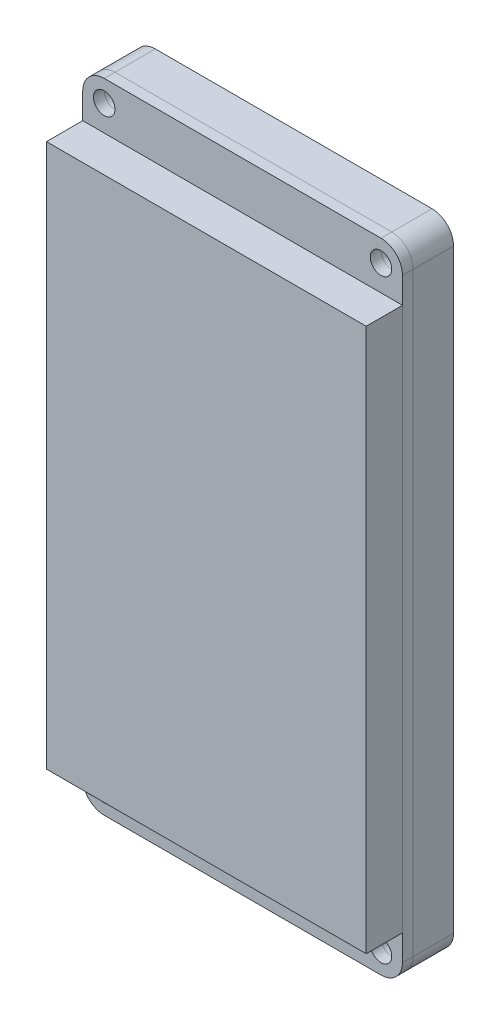
ISO-10303-21;
HEADER;
FILE_DESCRIPTION(('STEP AP214'),'2;1');
FILE_NAME('part.step','',(''),(''),'','','');
FILE_SCHEMA(('AUTOMOTIVE_DESIGN { 1 0 10303 214 1 1 1 1 }'));
ENDSEC;
DATA;
#1=APPLICATION_CONTEXT('core data for automotive mechanical design processes');
#2=APPLICATION_PROTOCOL_DEFINITION('international standard','automotive_design',2000,#1);
#3=PRODUCT_CONTEXT('',#1,'mechanical');
#4=PRODUCT('Part','Part','',(#3));
#5=PRODUCT_RELATED_PRODUCT_CATEGORY('part','',(#4));
#6=PRODUCT_DEFINITION_FORMATION('','',#4);
#7=PRODUCT_DEFINITION_CONTEXT('part definition',#1,'design');
#8=PRODUCT_DEFINITION('design','',#6,#7);
#9=PRODUCT_DEFINITION_SHAPE('','',#8);
#10=(LENGTH_UNIT() NAMED_UNIT(*) SI_UNIT(.MILLI.,.METRE.));
#11=(NAMED_UNIT(*) PLANE_ANGLE_UNIT() SI_UNIT($,.RADIAN.));
#12=(NAMED_UNIT(*) SI_UNIT($,.STERADIAN.) SOLID_ANGLE_UNIT());
#13=UNCERTAINTY_MEASURE_WITH_UNIT(LENGTH_MEASURE(1.E-05),#10,'distance_accuracy_value','');
#14=(GEOMETRIC_REPRESENTATION_CONTEXT(3) GLOBAL_UNCERTAINTY_ASSIGNED_CONTEXT((#13)) GLOBAL_UNIT_ASSIGNED_CONTEXT((#10,
#11,#12)) REPRESENTATION_CONTEXT('',''));
#15=CARTESIAN_POINT('',(0.,0.,0.));
#16=DIRECTION('',(0.,0.,1.));
#17=DIRECTION('',(1.,0.,0.));
#18=AXIS2_PLACEMENT_3D('',#15,#16,#17);
#19=CARTESIAN_POINT('',(-32.0415558117689,47.5,-6.));
#20=DIRECTION('',(1.,0.,0.));
#21=DIRECTION('',(0.,0.,-1.));
#22=AXIS2_PLACEMENT_3D('',#19,#20,#21);
#23=PLANE('',#22);
#24=DIRECTION('',(0.,1.,0.));
#25=VECTOR('',#24,1.);
#26=CARTESIAN_POINT('',(-32.0415558117689,47.5,0.));
#27=LINE('',#26,#25);
#28=CARTESIAN_POINT('',(-32.0415558117689,39.7,0.));
#29=VERTEX_POINT('',#28);
#30=CARTESIAN_POINT('',(-32.0415558117689,47.5,0.));
#31=VERTEX_POINT('',#30);
#32=EDGE_CURVE('E117',#29,#31,#27,.T.);
#33=ORIENTED_EDGE('',*,*,#32,.T.);
#34=DIRECTION('',(0.,0.,1.));
#35=VECTOR('',#34,1.);
#36=CARTESIAN_POINT('',(-32.0415558117689,47.5,-6.));
#37=LINE('',#36,#35);
#38=CARTESIAN_POINT('',(-32.0415558117689,47.5,-6.));
#39=VERTEX_POINT('',#38);
#40=EDGE_CURVE('E12',#39,#31,#37,.T.);
#41=ORIENTED_EDGE('',*,*,#40,.F.);
#42=DIRECTION('',(0.,1.,0.));
#43=VECTOR('',#42,1.);
#44=CARTESIAN_POINT('',(-32.0415558117689,47.5,-6.));
#45=LINE('',#44,#43);
#46=CARTESIAN_POINT('',(-32.0415558117689,39.7,-6.));
#47=VERTEX_POINT('',#46);
#48=EDGE_CURVE('E105',#47,#39,#45,.T.);
#49=ORIENTED_EDGE('',*,*,#48,.F.);
#50=DIRECTION('',(0.,0.,1.));
#51=VECTOR('',#50,1.);
#52=CARTESIAN_POINT('',(-32.0415558117689,39.7,-6.));
#53=LINE('',#52,#51);
#54=EDGE_CURVE('E113',#47,#29,#53,.T.);
#55=ORIENTED_EDGE('',*,*,#54,.T.);
#56=EDGE_LOOP('',(#33,#41,#49,#55));
#57=FACE_BOUND('',#56,.T.);
#58=ADVANCED_FACE('F54',(#57),#23,.F.);
#59=CARTESIAN_POINT('',(-32.0415558117689,47.5,-6.));
#60=DIRECTION('',(0.,-1.,0.));
#61=DIRECTION('',(0.,0.,-1.));
#62=AXIS2_PLACEMENT_3D('',#59,#60,#61);
#63=PLANE('',#62);
#64=DIRECTION('',(1.,0.,0.));
#65=VECTOR('',#64,1.);
#66=CARTESIAN_POINT('',(-32.0415558117689,47.5,0.));
#67=LINE('',#66,#65);
#68=CARTESIAN_POINT('',(-16.9215558117689,47.5,0.));
#69=VERTEX_POINT('',#68);
#70=EDGE_CURVE('E109',#31,#69,#67,.T.);
#71=ORIENTED_EDGE('',*,*,#70,.T.);
#72=DIRECTION('',(0.,0.,1.));
#73=VECTOR('',#72,1.);
#74=CARTESIAN_POINT('',(-16.9215558117689,47.5,-6.));
#75=LINE('',#74,#73);
#76=CARTESIAN_POINT('',(-16.9215558117689,47.5,-6.));
#77=VERTEX_POINT('',#76);
#78=EDGE_CURVE('E62',#77,#69,#75,.T.);
#79=ORIENTED_EDGE('',*,*,#78,.F.);
#80=DIRECTION('',(1.,0.,0.));
#81=VECTOR('',#80,1.);
#82=CARTESIAN_POINT('',(-32.0415558117689,47.5,-6.));
#83=LINE('',#82,#81);
#84=EDGE_CURVE('E100',#39,#77,#83,.T.);
#85=ORIENTED_EDGE('',*,*,#84,.F.);
#86=ORIENTED_EDGE('',*,*,#40,.T.);
#87=EDGE_LOOP('',(#71,#79,#85,#86));
#88=FACE_BOUND('',#87,.T.);
#89=ADVANCED_FACE('F108',(#88),#63,.F.);
#90=CARTESIAN_POINT('',(-16.9215558117689,47.5,-6.));
#91=DIRECTION('',(-1.,0.,0.));
#92=DIRECTION('',(0.,0.,1.));
#93=AXIS2_PLACEMENT_3D('',#90,#91,#92);
#94=PLANE('',#93);
#95=DIRECTION('',(0.,-1.,0.));
#96=VECTOR('',#95,1.);
#97=CARTESIAN_POINT('',(-16.9215558117689,47.5,0.));
#98=LINE('',#97,#96);
#99=CARTESIAN_POINT('',(-16.9215558117689,39.7,0.));
#100=VERTEX_POINT('',#99);
#101=EDGE_CURVE('E87',#69,#100,#98,.T.);
#102=ORIENTED_EDGE('',*,*,#101,.T.);
#103=DIRECTION('',(0.,0.,1.));
#104=VECTOR('',#103,1.);
#105=CARTESIAN_POINT('',(-16.9215558117689,39.7,-6.));
#106=LINE('',#105,#104);
#107=CARTESIAN_POINT('',(-16.9215558117689,39.7,-6.));
#108=VERTEX_POINT('',#107);
#109=EDGE_CURVE('E110',#108,#100,#106,.T.);
#110=ORIENTED_EDGE('',*,*,#109,.F.);
#111=DIRECTION('',(0.,-1.,0.));
#112=VECTOR('',#111,1.);
#113=CARTESIAN_POINT('',(-16.9215558117689,47.5,-6.));
#114=LINE('',#113,#112);
#115=EDGE_CURVE('E103',#77,#108,#114,.T.);
#116=ORIENTED_EDGE('',*,*,#115,.F.);
#117=ORIENTED_EDGE('',*,*,#78,.T.);
#118=EDGE_LOOP('',(#102,#110,#116,#117));
#119=FACE_BOUND('',#118,.T.);
#120=ADVANCED_FACE('F111',(#119),#94,.F.);
#121=CARTESIAN_POINT('',(-32.0415558117689,39.7,-6.));
#122=DIRECTION('',(0.,1.,0.));
#123=DIRECTION('',(0.,0.,1.));
#124=AXIS2_PLACEMENT_3D('',#121,#122,#123);
#125=PLANE('',#124);
#126=DIRECTION('',(-1.,0.,0.));
#127=VECTOR('',#126,1.);
#128=CARTESIAN_POINT('',(-32.0415558117689,39.7,0.));
#129=LINE('',#128,#127);
#130=EDGE_CURVE('E93',#100,#29,#129,.T.);
#131=ORIENTED_EDGE('',*,*,#130,.T.);
#132=ORIENTED_EDGE('',*,*,#54,.F.);
#133=DIRECTION('',(-1.,0.,0.));
#134=VECTOR('',#133,1.);
#135=CARTESIAN_POINT('',(-32.0415558117689,39.7,-6.));
#136=LINE('',#135,#134);
#137=EDGE_CURVE('E70',#108,#47,#136,.T.);
#138=ORIENTED_EDGE('',*,*,#137,.F.);
#139=ORIENTED_EDGE('',*,*,#109,.T.);
#140=EDGE_LOOP('',(#131,#132,#138,#139));
#141=FACE_BOUND('',#140,.T.);
#142=ADVANCED_FACE('F124',(#141),#125,.F.);
#143=CARTESIAN_POINT('',(0.,0.,-6.));
#144=DIRECTION('',(0.,0.,1.));
#145=DIRECTION('',(1.,0.,0.));
#146=AXIS2_PLACEMENT_3D('',#143,#144,#145);
#147=PLANE('',#146);
#148=ORIENTED_EDGE('',*,*,#48,.T.);
#149=ORIENTED_EDGE('',*,*,#84,.T.);
#150=ORIENTED_EDGE('',*,*,#115,.T.);
#151=ORIENTED_EDGE('',*,*,#137,.T.);
#152=EDGE_LOOP('',(#148,#149,#150,#151));
#153=FACE_BOUND('',#152,.T.);
#154=ADVANCED_FACE('F101',(#153),#147,.F.);
#155=CARTESIAN_POINT('',(0.,0.,0.));
#156=DIRECTION('',(0.,0.,1.));
#157=DIRECTION('',(1.,0.,0.));
#158=AXIS2_PLACEMENT_3D('',#155,#156,#157);
#159=PLANE('',#158);
#160=ORIENTED_EDGE('',*,*,#32,.F.);
#161=ORIENTED_EDGE('',*,*,#130,.F.);
#162=ORIENTED_EDGE('',*,*,#101,.F.);
#163=ORIENTED_EDGE('',*,*,#70,.F.);
#164=EDGE_LOOP('',(#160,#161,#162,#163));
#165=FACE_BOUND('',#164,.T.);
#166=ADVANCED_FACE('F127',(#165),#159,.T.);
#167=CLOSED_SHELL('',(#58,#89,#120,#142,#154,#166));
#168=MANIFOLD_SOLID_BREP('B2',#167);
#169=CARTESIAN_POINT('',(-3.88155581176895,-44.3,-6.));
#170=DIRECTION('',(0.,0.,1.));
#171=DIRECTION('',(1.,0.,0.));
#172=AXIS2_PLACEMENT_3D('',#169,#170,#171);
#173=CYLINDRICAL_SURFACE('',#172,3.2);
#174=CARTESIAN_POINT('',(-3.88155581176895,-44.3,0.));
#175=DIRECTION('',(0.,0.,1.));
#176=DIRECTION('',(-1.,0.,0.));
#177=AXIS2_PLACEMENT_3D('',#174,#175,#176);
#178=CIRCLE('',#177,3.2);
#179=CARTESIAN_POINT('',(-3.88155581176894,-47.5,0.));
#180=VERTEX_POINT('',#179);
#181=CARTESIAN_POINT('',(-0.681555811768944,-44.3,0.));
#182=VERTEX_POINT('',#181);
#183=EDGE_CURVE('E285',#180,#182,#178,.T.);
#184=ORIENTED_EDGE('',*,*,#183,.F.);
#185=DIRECTION('',(0.,0.,1.));
#186=VECTOR('',#185,1.);
#187=CARTESIAN_POINT('',(-3.88155581176894,-47.5,-6.));
#188=LINE('',#187,#186);
#189=CARTESIAN_POINT('',(-3.88155581176894,-47.5,-6.));
#190=VERTEX_POINT('',#189);
#191=EDGE_CURVE('E52',#190,#180,#188,.T.);
#192=ORIENTED_EDGE('',*,*,#191,.F.);
#193=CARTESIAN_POINT('',(-3.88155581176895,-44.3,-6.));
#194=DIRECTION('',(0.,0.,1.));
#195=DIRECTION('',(-1.,0.,0.));
#196=AXIS2_PLACEMENT_3D('',#193,#194,#195);
#197=CIRCLE('',#196,3.2);
#198=CARTESIAN_POINT('',(-0.681555811768944,-44.3,-6.));
#199=VERTEX_POINT('',#198);
#200=EDGE_CURVE('E306',#190,#199,#197,.T.);
#201=ORIENTED_EDGE('',*,*,#200,.T.);
#202=DIRECTION('',(0.,0.,1.));
#203=VECTOR('',#202,1.);
#204=CARTESIAN_POINT('',(-0.681555811768944,-44.3,-6.));
#205=LINE('',#204,#203);
#206=EDGE_CURVE('E191',#199,#182,#205,.T.);
#207=ORIENTED_EDGE('',*,*,#206,.T.);
#208=EDGE_LOOP('',(#184,#192,#201,#207));
#209=FACE_BOUND('',#208,.T.);
#210=ADVANCED_FACE('F188',(#209),#173,.T.);
#211=CARTESIAN_POINT('',(-3.88155581176894,-47.5,-6.));
#212=DIRECTION('',(0.,-1.,0.));
#213=DIRECTION('',(1.,0.,0.));
#214=AXIS2_PLACEMENT_3D('',#211,#212,#213);
#215=PLANE('',#214);
#216=DIRECTION('',(1.,0.,0.));
#217=VECTOR('',#216,1.);
#218=CARTESIAN_POINT('',(-3.88155581176894,-47.5,0.));
#219=LINE('',#218,#217);
#220=CARTESIAN_POINT('',(-45.081555811769,-47.5,0.));
#221=VERTEX_POINT('',#220);
#222=EDGE_CURVE('E304',#221,#180,#219,.T.);
#223=ORIENTED_EDGE('',*,*,#222,.F.);
#224=DIRECTION('',(0.,0.,1.));
#225=VECTOR('',#224,1.);
#226=CARTESIAN_POINT('',(-45.081555811769,-47.5,-6.));
#227=LINE('',#226,#225);
#228=CARTESIAN_POINT('',(-45.081555811769,-47.5,-6.));
#229=VERTEX_POINT('',#228);
#230=EDGE_CURVE('E197',#229,#221,#227,.T.);
#231=ORIENTED_EDGE('',*,*,#230,.F.);
#232=DIRECTION('',(1.,0.,0.));
#233=VECTOR('',#232,1.);
#234=CARTESIAN_POINT('',(-3.88155581176894,-47.5,-6.));
#235=LINE('',#234,#233);
#236=EDGE_CURVE('E275',#229,#190,#235,.T.);
#237=ORIENTED_EDGE('',*,*,#236,.T.);
#238=ORIENTED_EDGE('',*,*,#191,.T.);
#239=EDGE_LOOP('',(#223,#231,#237,#238));
#240=FACE_BOUND('',#239,.T.);
#241=ADVANCED_FACE('F318',(#240),#215,.T.);
#242=CARTESIAN_POINT('',(-45.081555811769,-44.3,-6.));
#243=DIRECTION('',(0.,0.,1.));
#244=DIRECTION('',(1.,0.,0.));
#245=AXIS2_PLACEMENT_3D('',#242,#243,#244);
#246=CYLINDRICAL_SURFACE('',#245,3.2);
#247=CARTESIAN_POINT('',(-45.081555811769,-44.3,0.));
#248=DIRECTION('',(0.,0.,1.));
#249=DIRECTION('',(-1.,0.,0.));
#250=AXIS2_PLACEMENT_3D('',#247,#248,#249);
#251=CIRCLE('',#250,3.2);
#252=CARTESIAN_POINT('',(-48.281555811769,-44.3,0.));
#253=VERTEX_POINT('',#252);
#254=EDGE_CURVE('E262',#253,#221,#251,.T.);
#255=ORIENTED_EDGE('',*,*,#254,.F.);
#256=DIRECTION('',(0.,0.,1.));
#257=VECTOR('',#256,1.);
#258=CARTESIAN_POINT('',(-48.281555811769,-44.3,-6.));
#259=LINE('',#258,#257);
#260=CARTESIAN_POINT('',(-48.281555811769,-44.3,-6.));
#261=VERTEX_POINT('',#260);
#262=EDGE_CURVE('E257',#261,#253,#259,.T.);
#263=ORIENTED_EDGE('',*,*,#262,.F.);
#264=CARTESIAN_POINT('',(-45.081555811769,-44.3,-6.));
#265=DIRECTION('',(0.,0.,1.));
#266=DIRECTION('',(-1.,0.,0.));
#267=AXIS2_PLACEMENT_3D('',#264,#265,#266);
#268=CIRCLE('',#267,3.2);
#269=EDGE_CURVE('E260',#261,#229,#268,.T.);
#270=ORIENTED_EDGE('',*,*,#269,.T.);
#271=ORIENTED_EDGE('',*,*,#230,.T.);
#272=EDGE_LOOP('',(#255,#263,#270,#271));
#273=FACE_BOUND('',#272,.T.);
#274=ADVANCED_FACE('F259',(#273),#246,.T.);
#275=CARTESIAN_POINT('',(-48.281555811769,-44.3,-6.));
#276=DIRECTION('',(-1.,0.,0.));
#277=DIRECTION('',(0.,-1.,0.));
#278=AXIS2_PLACEMENT_3D('',#275,#276,#277);
#279=PLANE('',#278);
#280=DIRECTION('',(0.,-1.,0.));
#281=VECTOR('',#280,1.);
#282=CARTESIAN_POINT('',(-48.281555811769,-44.3,0.));
#283=LINE('',#282,#281);
#284=CARTESIAN_POINT('',(-48.281555811769,44.3,0.));
#285=VERTEX_POINT('',#284);
#286=EDGE_CURVE('E301',#285,#253,#283,.T.);
#287=ORIENTED_EDGE('',*,*,#286,.F.);
#288=DIRECTION('',(0.,0.,1.));
#289=VECTOR('',#288,1.);
#290=CARTESIAN_POINT('',(-48.281555811769,44.3,-6.));
#291=LINE('',#290,#289);
#292=CARTESIAN_POINT('',(-48.281555811769,44.3,-6.));
#293=VERTEX_POINT('',#292);
#294=EDGE_CURVE('E267',#293,#285,#291,.T.);
#295=ORIENTED_EDGE('',*,*,#294,.F.);
#296=DIRECTION('',(0.,-1.,0.));
#297=VECTOR('',#296,1.);
#298=CARTESIAN_POINT('',(-48.281555811769,-44.3,-6.));
#299=LINE('',#298,#297);
#300=EDGE_CURVE('E273',#293,#261,#299,.T.);
#301=ORIENTED_EDGE('',*,*,#300,.T.);
#302=ORIENTED_EDGE('',*,*,#262,.T.);
#303=EDGE_LOOP('',(#287,#295,#301,#302));
#304=FACE_BOUND('',#303,.T.);
#305=ADVANCED_FACE('F277',(#304),#279,.T.);
#306=CARTESIAN_POINT('',(-45.081555811769,44.3,-6.));
#307=DIRECTION('',(0.,0.,1.));
#308=DIRECTION('',(1.,0.,0.));
#309=AXIS2_PLACEMENT_3D('',#306,#307,#308);
#310=CYLINDRICAL_SURFACE('',#309,3.2);
#311=CARTESIAN_POINT('',(-45.081555811769,44.3,0.));
#312=DIRECTION('',(0.,0.,1.));
#313=DIRECTION('',(-1.,0.,0.));
#314=AXIS2_PLACEMENT_3D('',#311,#312,#313);
#315=CIRCLE('',#314,3.2);
#316=CARTESIAN_POINT('',(-45.081555811769,47.5,0.));
#317=VERTEX_POINT('',#316);
#318=EDGE_CURVE('E298',#317,#285,#315,.T.);
#319=ORIENTED_EDGE('',*,*,#318,.F.);
#320=DIRECTION('',(0.,0.,1.));
#321=VECTOR('',#320,1.);
#322=CARTESIAN_POINT('',(-45.081555811769,47.5,-6.));
#323=LINE('',#322,#321);
#324=CARTESIAN_POINT('',(-45.081555811769,47.5,-6.));
#325=VERTEX_POINT('',#324);
#326=EDGE_CURVE('E310',#325,#317,#323,.T.);
#327=ORIENTED_EDGE('',*,*,#326,.F.);
#328=CARTESIAN_POINT('',(-45.081555811769,44.3,-6.));
#329=DIRECTION('',(0.,0.,1.));
#330=DIRECTION('',(-1.,0.,0.));
#331=AXIS2_PLACEMENT_3D('',#328,#329,#330);
#332=CIRCLE('',#331,3.2);
#333=EDGE_CURVE('E278',#325,#293,#332,.T.);
#334=ORIENTED_EDGE('',*,*,#333,.T.);
#335=ORIENTED_EDGE('',*,*,#294,.T.);
#336=EDGE_LOOP('',(#319,#327,#334,#335));
#337=FACE_BOUND('',#336,.T.);
#338=ADVANCED_FACE('F331',(#337),#310,.T.);
#339=CARTESIAN_POINT('',(-45.081555811769,47.5,-6.));
#340=DIRECTION('',(0.,1.,0.));
#341=DIRECTION('',(-1.,0.,0.));
#342=AXIS2_PLACEMENT_3D('',#339,#340,#341);
#343=PLANE('',#342);
#344=DIRECTION('',(-1.,0.,0.));
#345=VECTOR('',#344,1.);
#346=CARTESIAN_POINT('',(-45.081555811769,47.5,0.));
#347=LINE('',#346,#345);
#348=CARTESIAN_POINT('',(-3.88155581176896,47.5,0.));
#349=VERTEX_POINT('',#348);
#350=EDGE_CURVE('E295',#349,#317,#347,.T.);
#351=ORIENTED_EDGE('',*,*,#350,.F.);
#352=DIRECTION('',(0.,0.,1.));
#353=VECTOR('',#352,1.);
#354=CARTESIAN_POINT('',(-3.88155581176896,47.5,-6.));
#355=LINE('',#354,#353);
#356=CARTESIAN_POINT('',(-3.88155581176896,47.5,-6.));
#357=VERTEX_POINT('',#356);
#358=EDGE_CURVE('E312',#357,#349,#355,.T.);
#359=ORIENTED_EDGE('',*,*,#358,.F.);
#360=DIRECTION('',(-1.,0.,0.));
#361=VECTOR('',#360,1.);
#362=CARTESIAN_POINT('',(-45.081555811769,47.5,-6.));
#363=LINE('',#362,#361);
#364=EDGE_CURVE('E280',#357,#325,#363,.T.);
#365=ORIENTED_EDGE('',*,*,#364,.T.);
#366=ORIENTED_EDGE('',*,*,#326,.T.);
#367=EDGE_LOOP('',(#351,#359,#365,#366));
#368=FACE_BOUND('',#367,.T.);
#369=ADVANCED_FACE('F334',(#368),#343,.T.);
#370=CARTESIAN_POINT('',(-3.88155581176896,44.3,-6.));
#371=DIRECTION('',(0.,0.,1.));
#372=DIRECTION('',(1.,0.,0.));
#373=AXIS2_PLACEMENT_3D('',#370,#371,#372);
#374=CYLINDRICAL_SURFACE('',#373,3.2);
#375=CARTESIAN_POINT('',(-3.88155581176896,44.3,0.));
#376=DIRECTION('',(0.,0.,1.));
#377=DIRECTION('',(-1.,0.,0.));
#378=AXIS2_PLACEMENT_3D('',#375,#376,#377);
#379=CIRCLE('',#378,3.2);
#380=CARTESIAN_POINT('',(-0.681555811768955,44.3,0.));
#381=VERTEX_POINT('',#380);
#382=EDGE_CURVE('E292',#381,#349,#379,.T.);
#383=ORIENTED_EDGE('',*,*,#382,.F.);
#384=DIRECTION('',(0.,0.,1.));
#385=VECTOR('',#384,1.);
#386=CARTESIAN_POINT('',(-0.681555811768955,44.3,-6.));
#387=LINE('',#386,#385);
#388=CARTESIAN_POINT('',(-0.681555811768955,44.3,-6.));
#389=VERTEX_POINT('',#388);
#390=EDGE_CURVE('E313',#389,#381,#387,.T.);
#391=ORIENTED_EDGE('',*,*,#390,.F.);
#392=CARTESIAN_POINT('',(-3.88155581176896,44.3,-6.));
#393=DIRECTION('',(0.,0.,1.));
#394=DIRECTION('',(-1.,0.,0.));
#395=AXIS2_PLACEMENT_3D('',#392,#393,#394);
#396=CIRCLE('',#395,3.2);
#397=EDGE_CURVE('E400',#389,#357,#396,.T.);
#398=ORIENTED_EDGE('',*,*,#397,.T.);
#399=ORIENTED_EDGE('',*,*,#358,.T.);
#400=EDGE_LOOP('',(#383,#391,#398,#399));
#401=FACE_BOUND('',#400,.T.);
#402=ADVANCED_FACE('F338',(#401),#374,.T.);
#403=CARTESIAN_POINT('',(-0.681555811768955,44.3,-6.));
#404=DIRECTION('',(1.,0.,0.));
#405=DIRECTION('',(0.,1.,0.));
#406=AXIS2_PLACEMENT_3D('',#403,#404,#405);
#407=PLANE('',#406);
#408=DIRECTION('',(0.,1.,0.));
#409=VECTOR('',#408,1.);
#410=CARTESIAN_POINT('',(-0.681555811768955,44.3,0.));
#411=LINE('',#410,#409);
#412=EDGE_CURVE('E288',#182,#381,#411,.T.);
#413=ORIENTED_EDGE('',*,*,#412,.F.);
#414=ORIENTED_EDGE('',*,*,#206,.F.);
#415=DIRECTION('',(0.,1.,0.));
#416=VECTOR('',#415,1.);
#417=CARTESIAN_POINT('',(-0.681555811768955,44.3,-6.));
#418=LINE('',#417,#416);
#419=EDGE_CURVE('E398',#199,#389,#418,.T.);
#420=ORIENTED_EDGE('',*,*,#419,.T.);
#421=ORIENTED_EDGE('',*,*,#390,.T.);
#422=EDGE_LOOP('',(#413,#414,#420,#421));
#423=FACE_BOUND('',#422,.T.);
#424=ADVANCED_FACE('F315',(#423),#407,.T.);
#425=CARTESIAN_POINT('',(-3.88155581176895,-44.3,-6.));
#426=DIRECTION('',(0.,0.,-1.));
#427=DIRECTION('',(-1.,0.,0.));
#428=AXIS2_PLACEMENT_3D('',#425,#426,#427);
#429=PLANE('',#428);
#430=CARTESIAN_POINT('',(-45.081555811769,44.3,-6.));
#431=DIRECTION('',(0.,0.,1.));
#432=DIRECTION('',(1.,0.,0.));
#433=AXIS2_PLACEMENT_3D('',#430,#431,#432);
#434=CIRCLE('',#433,1.6);
#435=CARTESIAN_POINT('',(-43.481555811769,44.3,-6.));
#436=VERTEX_POINT('',#435);
#437=EDGE_CURVE('E373',#436,#436,#434,.T.);
#438=ORIENTED_EDGE('',*,*,#437,.T.);
#439=EDGE_LOOP('',(#438));
#440=FACE_BOUND('',#439,.T.);
#441=CARTESIAN_POINT('',(-3.88155581176895,-44.3,-6.));
#442=DIRECTION('',(0.,0.,1.));
#443=DIRECTION('',(1.,0.,0.));
#444=AXIS2_PLACEMENT_3D('',#441,#442,#443);
#445=CIRCLE('',#444,1.60000000000001);
#446=CARTESIAN_POINT('',(-2.28155581176894,-44.3,-6.));
#447=VERTEX_POINT('',#446);
#448=EDGE_CURVE('E381',#447,#447,#445,.T.);
#449=ORIENTED_EDGE('',*,*,#448,.T.);
#450=EDGE_LOOP('',(#449));
#451=FACE_BOUND('',#450,.T.);
#452=CARTESIAN_POINT('',(-3.88155581176896,44.3,-6.));
#453=DIRECTION('',(0.,0.,1.));
#454=DIRECTION('',(1.,0.,0.));
#455=AXIS2_PLACEMENT_3D('',#452,#453,#454);
#456=CIRCLE('',#455,1.60000000000001);
#457=CARTESIAN_POINT('',(-2.28155581176895,44.3,-6.));
#458=VERTEX_POINT('',#457);
#459=EDGE_CURVE('E387',#458,#458,#456,.T.);
#460=ORIENTED_EDGE('',*,*,#459,.T.);
#461=EDGE_LOOP('',(#460));
#462=FACE_BOUND('',#461,.T.);
#463=CARTESIAN_POINT('',(-45.081555811769,-44.3,-6.));
#464=DIRECTION('',(0.,0.,1.));
#465=DIRECTION('',(1.,0.,0.));
#466=AXIS2_PLACEMENT_3D('',#463,#464,#465);
#467=CIRCLE('',#466,1.6);
#468=CARTESIAN_POINT('',(-43.481555811769,-44.3,-6.));
#469=VERTEX_POINT('',#468);
#470=EDGE_CURVE('E289',#469,#469,#467,.T.);
#471=ORIENTED_EDGE('',*,*,#470,.T.);
#472=EDGE_LOOP('',(#471));
#473=FACE_BOUND('',#472,.T.);
#474=ORIENTED_EDGE('',*,*,#200,.F.);
#475=ORIENTED_EDGE('',*,*,#236,.F.);
#476=ORIENTED_EDGE('',*,*,#269,.F.);
#477=ORIENTED_EDGE('',*,*,#300,.F.);
#478=ORIENTED_EDGE('',*,*,#333,.F.);
#479=ORIENTED_EDGE('',*,*,#364,.F.);
#480=ORIENTED_EDGE('',*,*,#397,.F.);
#481=ORIENTED_EDGE('',*,*,#419,.F.);
#482=EDGE_LOOP('',(#474,#475,#476,#477,#478,#479,#480,#481));
#483=FACE_BOUND('',#482,.T.);
#484=ADVANCED_FACE('F271',(#440,#451,#462,#473,#483),#429,.T.);
#485=CARTESIAN_POINT('',(-3.88155581176895,-44.3,0.));
#486=DIRECTION('',(0.,0.,-1.));
#487=DIRECTION('',(-1.,0.,0.));
#488=AXIS2_PLACEMENT_3D('',#485,#486,#487);
#489=PLANE('',#488);
#490=CARTESIAN_POINT('',(-45.081555811769,44.3,0.));
#491=DIRECTION('',(0.,0.,1.));
#492=DIRECTION('',(1.,0.,0.));
#493=AXIS2_PLACEMENT_3D('',#490,#491,#492);
#494=CIRCLE('',#493,1.6);
#495=CARTESIAN_POINT('',(-43.481555811769,44.3,0.));
#496=VERTEX_POINT('',#495);
#497=EDGE_CURVE('E376',#496,#496,#494,.T.);
#498=ORIENTED_EDGE('',*,*,#497,.F.);
#499=EDGE_LOOP('',(#498));
#500=FACE_BOUND('',#499,.T.);
#501=CARTESIAN_POINT('',(-3.88155581176895,-44.3,0.));
#502=DIRECTION('',(0.,0.,1.));
#503=DIRECTION('',(1.,0.,0.));
#504=AXIS2_PLACEMENT_3D('',#501,#502,#503);
#505=CIRCLE('',#504,1.60000000000001);
#506=CARTESIAN_POINT('',(-2.28155581176894,-44.3,0.));
#507=VERTEX_POINT('',#506);
#508=EDGE_CURVE('E378',#507,#507,#505,.T.);
#509=ORIENTED_EDGE('',*,*,#508,.F.);
#510=EDGE_LOOP('',(#509));
#511=FACE_BOUND('',#510,.T.);
#512=CARTESIAN_POINT('',(-3.88155581176896,44.3,0.));
#513=DIRECTION('',(0.,0.,1.));
#514=DIRECTION('',(1.,0.,0.));
#515=AXIS2_PLACEMENT_3D('',#512,#513,#514);
#516=CIRCLE('',#515,1.60000000000001);
#517=CARTESIAN_POINT('',(-2.28155581176895,44.3,0.));
#518=VERTEX_POINT('',#517);
#519=EDGE_CURVE('E384',#518,#518,#516,.T.);
#520=ORIENTED_EDGE('',*,*,#519,.F.);
#521=EDGE_LOOP('',(#520));
#522=FACE_BOUND('',#521,.T.);
#523=CARTESIAN_POINT('',(-45.081555811769,-44.3,0.));
#524=DIRECTION('',(0.,0.,1.));
#525=DIRECTION('',(1.,0.,0.));
#526=AXIS2_PLACEMENT_3D('',#523,#524,#525);
#527=CIRCLE('',#526,1.6);
#528=CARTESIAN_POINT('',(-43.481555811769,-44.3,0.));
#529=VERTEX_POINT('',#528);
#530=EDGE_CURVE('E390',#529,#529,#527,.T.);
#531=ORIENTED_EDGE('',*,*,#530,.F.);
#532=EDGE_LOOP('',(#531));
#533=FACE_BOUND('',#532,.T.);
#534=ORIENTED_EDGE('',*,*,#183,.T.);
#535=ORIENTED_EDGE('',*,*,#412,.T.);
#536=ORIENTED_EDGE('',*,*,#382,.T.);
#537=ORIENTED_EDGE('',*,*,#350,.T.);
#538=ORIENTED_EDGE('',*,*,#318,.T.);
#539=ORIENTED_EDGE('',*,*,#286,.T.);
#540=ORIENTED_EDGE('',*,*,#254,.T.);
#541=ORIENTED_EDGE('',*,*,#222,.T.);
#542=EDGE_LOOP('',(#534,#535,#536,#537,#538,#539,#540,#541));
#543=FACE_BOUND('',#542,.T.);
#544=ADVANCED_FACE('F317',(#500,#511,#522,#533,#543),#489,.F.);
#545=CARTESIAN_POINT('',(-45.081555811769,-44.3,-6.));
#546=DIRECTION('',(0.,0.,1.));
#547=DIRECTION('',(1.,0.,0.));
#548=AXIS2_PLACEMENT_3D('',#545,#546,#547);
#549=CYLINDRICAL_SURFACE('',#548,1.6);
#550=ORIENTED_EDGE('',*,*,#470,.F.);
#551=EDGE_LOOP('',(#550));
#552=FACE_BOUND('',#551,.T.);
#553=ORIENTED_EDGE('',*,*,#530,.T.);
#554=EDGE_LOOP('',(#553));
#555=FACE_BOUND('',#554,.T.);
#556=ADVANCED_FACE('F350',(#552,#555),#549,.F.);
#557=CARTESIAN_POINT('',(-3.88155581176896,44.3,-6.));
#558=DIRECTION('',(0.,0.,1.));
#559=DIRECTION('',(1.,0.,0.));
#560=AXIS2_PLACEMENT_3D('',#557,#558,#559);
#561=CYLINDRICAL_SURFACE('',#560,1.60000000000001);
#562=ORIENTED_EDGE('',*,*,#459,.F.);
#563=EDGE_LOOP('',(#562));
#564=FACE_BOUND('',#563,.T.);
#565=ORIENTED_EDGE('',*,*,#519,.T.);
#566=EDGE_LOOP('',(#565));
#567=FACE_BOUND('',#566,.T.);
#568=ADVANCED_FACE('F357',(#564,#567),#561,.F.);
#569=CARTESIAN_POINT('',(-3.88155581176895,-44.3,-6.));
#570=DIRECTION('',(0.,0.,1.));
#571=DIRECTION('',(1.,0.,0.));
#572=AXIS2_PLACEMENT_3D('',#569,#570,#571);
#573=CYLINDRICAL_SURFACE('',#572,1.60000000000001);
#574=ORIENTED_EDGE('',*,*,#448,.F.);
#575=EDGE_LOOP('',(#574));
#576=FACE_BOUND('',#575,.T.);
#577=ORIENTED_EDGE('',*,*,#508,.T.);
#578=EDGE_LOOP('',(#577));
#579=FACE_BOUND('',#578,.T.);
#580=ADVANCED_FACE('F361',(#576,#579),#573,.F.);
#581=CARTESIAN_POINT('',(-45.081555811769,44.3,-6.));
#582=DIRECTION('',(0.,0.,1.));
#583=DIRECTION('',(1.,0.,0.));
#584=AXIS2_PLACEMENT_3D('',#581,#582,#583);
#585=CYLINDRICAL_SURFACE('',#584,1.6);
#586=ORIENTED_EDGE('',*,*,#437,.F.);
#587=EDGE_LOOP('',(#586));
#588=FACE_BOUND('',#587,.T.);
#589=ORIENTED_EDGE('',*,*,#497,.T.);
#590=EDGE_LOOP('',(#589));
#591=FACE_BOUND('',#590,.T.);
#592=ADVANCED_FACE('F365',(#588,#591),#585,.F.);
#593=CLOSED_SHELL('',(#210,#241,#274,#305,#338,#369,#402,#424,#484,#544,#556,#568,#580,#592));
#594=MANIFOLD_SOLID_BREP('B6',#593);
#595=CARTESIAN_POINT('',(-48.281555811769,40.45,7.));
#596=DIRECTION('',(1.,0.,0.));
#597=DIRECTION('',(0.,1.,0.));
#598=AXIS2_PLACEMENT_3D('',#595,#596,#597);
#599=PLANE('',#598);
#600=DIRECTION('',(0.,-1.,0.));
#601=VECTOR('',#600,1.);
#602=CARTESIAN_POINT('',(-48.281555811769,40.45,1.6));
#603=LINE('',#602,#601);
#604=CARTESIAN_POINT('',(-48.281555811769,40.45,1.6));
#605=VERTEX_POINT('',#604);
#606=CARTESIAN_POINT('',(-48.281555811769,-40.45,1.6));
#607=VERTEX_POINT('',#606);
#608=EDGE_CURVE('E572',#605,#607,#603,.T.);
#609=ORIENTED_EDGE('',*,*,#608,.T.);
#610=DIRECTION('',(0.,0.,-1.));
#611=VECTOR('',#610,1.);
#612=CARTESIAN_POINT('',(-48.281555811769,-40.45,7.));
#613=LINE('',#612,#611);
#614=CARTESIAN_POINT('',(-48.281555811769,-40.45,7.));
#615=VERTEX_POINT('',#614);
#616=EDGE_CURVE('E186',#615,#607,#613,.T.);
#617=ORIENTED_EDGE('',*,*,#616,.F.);
#618=DIRECTION('',(0.,-1.,0.));
#619=VECTOR('',#618,1.);
#620=CARTESIAN_POINT('',(-48.281555811769,40.45,7.));
#621=LINE('',#620,#619);
#622=CARTESIAN_POINT('',(-48.281555811769,40.45,7.));
#623=VERTEX_POINT('',#622);
#624=EDGE_CURVE('E560',#623,#615,#621,.T.);
#625=ORIENTED_EDGE('',*,*,#624,.F.);
#626=DIRECTION('',(0.,0.,-1.));
#627=VECTOR('',#626,1.);
#628=CARTESIAN_POINT('',(-48.281555811769,40.45,7.));
#629=LINE('',#628,#627);
#630=EDGE_CURVE('E568',#623,#605,#629,.T.);
#631=ORIENTED_EDGE('',*,*,#630,.T.);
#632=EDGE_LOOP('',(#609,#617,#625,#631));
#633=FACE_BOUND('',#632,.T.);
#634=ADVANCED_FACE('F509',(#633),#599,.F.);
#635=CARTESIAN_POINT('',(-48.281555811769,-40.45,7.));
#636=DIRECTION('',(0.,1.,0.));
#637=DIRECTION('',(-1.,0.,0.));
#638=AXIS2_PLACEMENT_3D('',#635,#636,#637);
#639=PLANE('',#638);
#640=DIRECTION('',(1.,0.,0.));
#641=VECTOR('',#640,1.);
#642=CARTESIAN_POINT('',(-48.281555811769,-40.45,1.6));
#643=LINE('',#642,#641);
#644=CARTESIAN_POINT('',(-0.681555811768958,-40.45,1.6));
#645=VERTEX_POINT('',#644);
#646=EDGE_CURVE('E564',#607,#645,#643,.T.);
#647=ORIENTED_EDGE('',*,*,#646,.T.);
#648=DIRECTION('',(0.,0.,-1.));
#649=VECTOR('',#648,1.);
#650=CARTESIAN_POINT('',(-0.681555811768958,-40.45,7.));
#651=LINE('',#650,#649);
#652=CARTESIAN_POINT('',(-0.681555811768958,-40.45,7.));
#653=VERTEX_POINT('',#652);
#654=EDGE_CURVE('E517',#653,#645,#651,.T.);
#655=ORIENTED_EDGE('',*,*,#654,.F.);
#656=DIRECTION('',(1.,0.,0.));
#657=VECTOR('',#656,1.);
#658=CARTESIAN_POINT('',(-48.281555811769,-40.45,7.));
#659=LINE('',#658,#657);
#660=EDGE_CURVE('E555',#615,#653,#659,.T.);
#661=ORIENTED_EDGE('',*,*,#660,.F.);
#662=ORIENTED_EDGE('',*,*,#616,.T.);
#663=EDGE_LOOP('',(#647,#655,#661,#662));
#664=FACE_BOUND('',#663,.T.);
#665=ADVANCED_FACE('F563',(#664),#639,.F.);
#666=CARTESIAN_POINT('',(-0.681555811768965,40.45,7.));
#667=DIRECTION('',(-1.,0.,0.));
#668=DIRECTION('',(0.,-1.,0.));
#669=AXIS2_PLACEMENT_3D('',#666,#667,#668);
#670=PLANE('',#669);
#671=DIRECTION('',(0.,1.,0.));
#672=VECTOR('',#671,1.);
#673=CARTESIAN_POINT('',(-0.681555811768965,40.45,1.6));
#674=LINE('',#673,#672);
#675=CARTESIAN_POINT('',(-0.681555811768965,40.45,1.6));
#676=VERTEX_POINT('',#675);
#677=EDGE_CURVE('E542',#645,#676,#674,.T.);
#678=ORIENTED_EDGE('',*,*,#677,.T.);
#679=DIRECTION('',(0.,0.,-1.));
#680=VECTOR('',#679,1.);
#681=CARTESIAN_POINT('',(-0.681555811768965,40.45,7.));
#682=LINE('',#681,#680);
#683=CARTESIAN_POINT('',(-0.681555811768965,40.45,7.));
#684=VERTEX_POINT('',#683);
#685=EDGE_CURVE('E565',#684,#676,#682,.T.);
#686=ORIENTED_EDGE('',*,*,#685,.F.);
#687=DIRECTION('',(0.,1.,0.));
#688=VECTOR('',#687,1.);
#689=CARTESIAN_POINT('',(-0.681555811768965,40.45,7.));
#690=LINE('',#689,#688);
#691=EDGE_CURVE('E558',#653,#684,#690,.T.);
#692=ORIENTED_EDGE('',*,*,#691,.F.);
#693=ORIENTED_EDGE('',*,*,#654,.T.);
#694=EDGE_LOOP('',(#678,#686,#692,#693));
#695=FACE_BOUND('',#694,.T.);
#696=ADVANCED_FACE('F566',(#695),#670,.F.);
#697=CARTESIAN_POINT('',(-48.281555811769,40.45,7.));
#698=DIRECTION('',(0.,-1.,0.));
#699=DIRECTION('',(1.,0.,0.));
#700=AXIS2_PLACEMENT_3D('',#697,#698,#699);
#701=PLANE('',#700);
#702=DIRECTION('',(-1.,0.,0.));
#703=VECTOR('',#702,1.);
#704=CARTESIAN_POINT('',(-48.281555811769,40.45,1.6));
#705=LINE('',#704,#703);
#706=EDGE_CURVE('E548',#676,#605,#705,.T.);
#707=ORIENTED_EDGE('',*,*,#706,.T.);
#708=ORIENTED_EDGE('',*,*,#630,.F.);
#709=DIRECTION('',(-1.,0.,0.));
#710=VECTOR('',#709,1.);
#711=CARTESIAN_POINT('',(-48.281555811769,40.45,7.));
#712=LINE('',#711,#710);
#713=EDGE_CURVE('E525',#684,#623,#712,.T.);
#714=ORIENTED_EDGE('',*,*,#713,.F.);
#715=ORIENTED_EDGE('',*,*,#685,.T.);
#716=EDGE_LOOP('',(#707,#708,#714,#715));
#717=FACE_BOUND('',#716,.T.);
#718=ADVANCED_FACE('F579',(#717),#701,.F.);
#719=CARTESIAN_POINT('',(0.,0.,7.));
#720=DIRECTION('',(0.,0.,1.));
#721=DIRECTION('',(1.,0.,0.));
#722=AXIS2_PLACEMENT_3D('',#719,#720,#721);
#723=PLANE('',#722);
#724=ORIENTED_EDGE('',*,*,#624,.T.);
#725=ORIENTED_EDGE('',*,*,#660,.T.);
#726=ORIENTED_EDGE('',*,*,#691,.T.);
#727=ORIENTED_EDGE('',*,*,#713,.T.);
#728=EDGE_LOOP('',(#724,#725,#726,#727));
#729=FACE_BOUND('',#728,.T.);
#730=ADVANCED_FACE('F556',(#729),#723,.T.);
#731=CARTESIAN_POINT('',(0.,0.,1.6));
#732=DIRECTION('',(0.,0.,1.));
#733=DIRECTION('',(1.,0.,0.));
#734=AXIS2_PLACEMENT_3D('',#731,#732,#733);
#735=PLANE('',#734);
#736=ORIENTED_EDGE('',*,*,#608,.F.);
#737=ORIENTED_EDGE('',*,*,#706,.F.);
#738=ORIENTED_EDGE('',*,*,#677,.F.);
#739=ORIENTED_EDGE('',*,*,#646,.F.);
#740=EDGE_LOOP('',(#736,#737,#738,#739));
#741=FACE_BOUND('',#740,.T.);
#742=ADVANCED_FACE('F582',(#741),#735,.F.);
#743=CLOSED_SHELL('',(#634,#665,#696,#718,#730,#742));
#744=MANIFOLD_SOLID_BREP('B46',#743);
#745=CARTESIAN_POINT('',(-3.88155581176895,-44.3,1.6));
#746=DIRECTION('',(0.,0.,-1.));
#747=DIRECTION('',(-1.,0.,0.));
#748=AXIS2_PLACEMENT_3D('',#745,#746,#747);
#749=PLANE('',#748);
#750=CARTESIAN_POINT('',(-3.88155581176895,-44.3,1.6));
#751=DIRECTION('',(0.,0.,1.));
#752=DIRECTION('',(-1.,0.,0.));
#753=AXIS2_PLACEMENT_3D('',#750,#751,#752);
#754=CIRCLE('',#753,3.2);
#755=CARTESIAN_POINT('',(-3.88155581176894,-47.5,1.6));
#756=VERTEX_POINT('',#755);
#757=CARTESIAN_POINT('',(-0.681555811768944,-44.3,1.6));
#758=VERTEX_POINT('',#757);
#759=EDGE_CURVE('E745',#756,#758,#754,.T.);
#760=ORIENTED_EDGE('',*,*,#759,.T.);
#761=DIRECTION('',(0.,1.,0.));
#762=VECTOR('',#761,1.);
#763=CARTESIAN_POINT('',(-0.681555811768955,44.3,1.6));
#764=LINE('',#763,#762);
#765=CARTESIAN_POINT('',(-0.681555811768955,44.3,1.6));
#766=VERTEX_POINT('',#765);
#767=EDGE_CURVE('E693',#758,#766,#764,.T.);
#768=ORIENTED_EDGE('',*,*,#767,.T.);
#769=CARTESIAN_POINT('',(-3.88155581176896,44.3,1.6));
#770=DIRECTION('',(0.,0.,1.));
#771=DIRECTION('',(-1.,0.,0.));
#772=AXIS2_PLACEMENT_3D('',#769,#770,#771);
#773=CIRCLE('',#772,3.2);
#774=CARTESIAN_POINT('',(-3.88155581176896,47.5,1.6));
#775=VERTEX_POINT('',#774);
#776=EDGE_CURVE('E760',#766,#775,#773,.T.);
#777=ORIENTED_EDGE('',*,*,#776,.T.);
#778=DIRECTION('',(-1.,0.,0.));
#779=VECTOR('',#778,1.);
#780=CARTESIAN_POINT('',(-45.081555811769,47.5,1.6));
#781=LINE('',#780,#779);
#782=CARTESIAN_POINT('',(-45.081555811769,47.5,1.6));
#783=VERTEX_POINT('',#782);
#784=EDGE_CURVE('E773',#775,#783,#781,.T.);
#785=ORIENTED_EDGE('',*,*,#784,.T.);
#786=CARTESIAN_POINT('',(-45.081555811769,44.3,1.6));
#787=DIRECTION('',(0.,0.,1.));
#788=DIRECTION('',(-1.,0.,0.));
#789=AXIS2_PLACEMENT_3D('',#786,#787,#788);
#790=CIRCLE('',#789,3.2);
#791=CARTESIAN_POINT('',(-48.281555811769,44.3,1.6));
#792=VERTEX_POINT('',#791);
#793=EDGE_CURVE('E712',#783,#792,#790,.T.);
#794=ORIENTED_EDGE('',*,*,#793,.T.);
#795=DIRECTION('',(0.,-1.,0.));
#796=VECTOR('',#795,1.);
#797=CARTESIAN_POINT('',(-48.281555811769,-44.3,1.6));
#798=LINE('',#797,#796);
#799=CARTESIAN_POINT('',(-48.281555811769,-44.3,1.6));
#800=VERTEX_POINT('',#799);
#801=EDGE_CURVE('E706',#792,#800,#798,.T.);
#802=ORIENTED_EDGE('',*,*,#801,.T.);
#803=CARTESIAN_POINT('',(-45.081555811769,-44.3,1.6));
#804=DIRECTION('',(0.,0.,1.));
#805=DIRECTION('',(-1.,0.,0.));
#806=AXIS2_PLACEMENT_3D('',#803,#804,#805);
#807=CIRCLE('',#806,3.2);
#808=CARTESIAN_POINT('',(-45.081555811769,-47.5,1.6));
#809=VERTEX_POINT('',#808);
#810=EDGE_CURVE('E710',#800,#809,#807,.T.);
#811=ORIENTED_EDGE('',*,*,#810,.T.);
#812=DIRECTION('',(1.,0.,0.));
#813=VECTOR('',#812,1.);
#814=CARTESIAN_POINT('',(-3.88155581176894,-47.5,1.6));
#815=LINE('',#814,#813);
#816=EDGE_CURVE('E650',#809,#756,#815,.T.);
#817=ORIENTED_EDGE('',*,*,#816,.T.);
#818=EDGE_LOOP('',(#760,#768,#777,#785,#794,#802,#811,#817));
#819=FACE_BOUND('',#818,.T.);
#820=CARTESIAN_POINT('',(-45.081555811769,-44.3,1.6));
#821=DIRECTION('',(0.,0.,1.));
#822=DIRECTION('',(1.,0.,0.));
#823=AXIS2_PLACEMENT_3D('',#820,#821,#822);
#824=CIRCLE('',#823,1.6);
#825=CARTESIAN_POINT('',(-43.481555811769,-44.3,1.6));
#826=VERTEX_POINT('',#825);
#827=EDGE_CURVE('E734',#826,#826,#824,.T.);
#828=ORIENTED_EDGE('',*,*,#827,.F.);
#829=EDGE_LOOP('',(#828));
#830=FACE_BOUND('',#829,.T.);
#831=CARTESIAN_POINT('',(-3.88155581176896,44.3,1.6));
#832=DIRECTION('',(0.,0.,1.));
#833=DIRECTION('',(1.,0.,0.));
#834=AXIS2_PLACEMENT_3D('',#831,#832,#833);
#835=CIRCLE('',#834,1.60000000000001);
#836=CARTESIAN_POINT('',(-2.28155581176895,44.3,1.6));
#837=VERTEX_POINT('',#836);
#838=EDGE_CURVE('E782',#837,#837,#835,.T.);
#839=ORIENTED_EDGE('',*,*,#838,.F.);
#840=EDGE_LOOP('',(#839));
#841=FACE_BOUND('',#840,.T.);
#842=CARTESIAN_POINT('',(-3.88155581176895,-44.3,1.6));
#843=DIRECTION('',(0.,0.,1.));
#844=DIRECTION('',(1.,0.,0.));
#845=AXIS2_PLACEMENT_3D('',#842,#843,#844);
#846=CIRCLE('',#845,1.60000000000001);
#847=CARTESIAN_POINT('',(-2.28155581176894,-44.3,1.6));
#848=VERTEX_POINT('',#847);
#849=EDGE_CURVE('E788',#848,#848,#846,.T.);
#850=ORIENTED_EDGE('',*,*,#849,.F.);
#851=EDGE_LOOP('',(#850));
#852=FACE_BOUND('',#851,.T.);
#853=CARTESIAN_POINT('',(-45.081555811769,44.3,1.6));
#854=DIRECTION('',(0.,0.,1.));
#855=DIRECTION('',(1.,0.,0.));
#856=AXIS2_PLACEMENT_3D('',#853,#854,#855);
#857=CIRCLE('',#856,1.6);
#858=CARTESIAN_POINT('',(-43.481555811769,44.3,1.6));
#859=VERTEX_POINT('',#858);
#860=EDGE_CURVE('E794',#859,#859,#857,.T.);
#861=ORIENTED_EDGE('',*,*,#860,.F.);
#862=EDGE_LOOP('',(#861));
#863=FACE_BOUND('',#862,.T.);
#864=ADVANCED_FACE('F633',(#819,#830,#841,#852,#863),#749,.F.);
#865=CARTESIAN_POINT('',(-3.88155581176895,-44.3,0.));
#866=DIRECTION('',(0.,0.,-1.));
#867=DIRECTION('',(-1.,0.,0.));
#868=AXIS2_PLACEMENT_3D('',#865,#866,#867);
#869=PLANE('',#868);
#870=CARTESIAN_POINT('',(-3.88155581176895,-44.3,0.));
#871=DIRECTION('',(0.,0.,1.));
#872=DIRECTION('',(1.,0.,0.));
#873=AXIS2_PLACEMENT_3D('',#870,#871,#872);
#874=CIRCLE('',#873,1.60000000000001);
#875=CARTESIAN_POINT('',(-2.28155581176894,-44.3,0.));
#876=VERTEX_POINT('',#875);
#877=EDGE_CURVE('E791',#876,#876,#874,.T.);
#878=ORIENTED_EDGE('',*,*,#877,.T.);
#879=EDGE_LOOP('',(#878));
#880=FACE_BOUND('',#879,.T.);
#881=CARTESIAN_POINT('',(-45.081555811769,-44.3,0.));
#882=DIRECTION('',(0.,0.,1.));
#883=DIRECTION('',(1.,0.,0.));
#884=AXIS2_PLACEMENT_3D('',#881,#882,#883);
#885=CIRCLE('',#884,1.6);
#886=CARTESIAN_POINT('',(-43.481555811769,-44.3,0.));
#887=VERTEX_POINT('',#886);
#888=EDGE_CURVE('E779',#887,#887,#885,.T.);
#889=ORIENTED_EDGE('',*,*,#888,.T.);
#890=EDGE_LOOP('',(#889));
#891=FACE_BOUND('',#890,.T.);
#892=CARTESIAN_POINT('',(-3.88155581176895,-44.3,0.));
#893=DIRECTION('',(0.,0.,1.));
#894=DIRECTION('',(-1.,0.,0.));
#895=AXIS2_PLACEMENT_3D('',#892,#893,#894);
#896=CIRCLE('',#895,3.2);
#897=CARTESIAN_POINT('',(-3.88155581176894,-47.5,0.));
#898=VERTEX_POINT('',#897);
#899=CARTESIAN_POINT('',(-0.681555811768944,-44.3,0.));
#900=VERTEX_POINT('',#899);
#901=EDGE_CURVE('E730',#898,#900,#896,.T.);
#902=ORIENTED_EDGE('',*,*,#901,.F.);
#903=DIRECTION('',(1.,0.,0.));
#904=VECTOR('',#903,1.);
#905=CARTESIAN_POINT('',(-3.88155581176894,-47.5,0.));
#906=LINE('',#905,#904);
#907=CARTESIAN_POINT('',(-45.081555811769,-47.5,0.));
#908=VERTEX_POINT('',#907);
#909=EDGE_CURVE('E685',#908,#898,#906,.T.);
#910=ORIENTED_EDGE('',*,*,#909,.F.);
#911=CARTESIAN_POINT('',(-45.081555811769,-44.3,0.));
#912=DIRECTION('',(0.,0.,1.));
#913=DIRECTION('',(-1.,0.,0.));
#914=AXIS2_PLACEMENT_3D('',#911,#912,#913);
#915=CIRCLE('',#914,3.2);
#916=CARTESIAN_POINT('',(-48.281555811769,-44.3,0.));
#917=VERTEX_POINT('',#916);
#918=EDGE_CURVE('E679',#917,#908,#915,.T.);
#919=ORIENTED_EDGE('',*,*,#918,.F.);
#920=DIRECTION('',(0.,-1.,0.));
#921=VECTOR('',#920,1.);
#922=CARTESIAN_POINT('',(-48.281555811769,-44.3,0.));
#923=LINE('',#922,#921);
#924=CARTESIAN_POINT('',(-48.281555811769,44.3,0.));
#925=VERTEX_POINT('',#924);
#926=EDGE_CURVE('E720',#925,#917,#923,.T.);
#927=ORIENTED_EDGE('',*,*,#926,.F.);
#928=CARTESIAN_POINT('',(-45.081555811769,44.3,0.));
#929=DIRECTION('',(0.,0.,1.));
#930=DIRECTION('',(-1.,0.,0.));
#931=AXIS2_PLACEMENT_3D('',#928,#929,#930);
#932=CIRCLE('',#931,3.2);
#933=CARTESIAN_POINT('',(-45.081555811769,47.5,0.));
#934=VERTEX_POINT('',#933);
#935=EDGE_CURVE('E740',#934,#925,#932,.T.);
#936=ORIENTED_EDGE('',*,*,#935,.F.);
#937=DIRECTION('',(-1.,0.,0.));
#938=VECTOR('',#937,1.);
#939=CARTESIAN_POINT('',(-45.081555811769,47.5,0.));
#940=LINE('',#939,#938);
#941=CARTESIAN_POINT('',(-3.88155581176896,47.5,0.));
#942=VERTEX_POINT('',#941);
#943=EDGE_CURVE('E738',#942,#934,#940,.T.);
#944=ORIENTED_EDGE('',*,*,#943,.F.);
#945=CARTESIAN_POINT('',(-3.88155581176896,44.3,0.));
#946=DIRECTION('',(0.,0.,1.));
#947=DIRECTION('',(-1.,0.,0.));
#948=AXIS2_PLACEMENT_3D('',#945,#946,#947);
#949=CIRCLE('',#948,3.2);
#950=CARTESIAN_POINT('',(-0.681555811768955,44.3,0.));
#951=VERTEX_POINT('',#950);
#952=EDGE_CURVE('E736',#951,#942,#949,.T.);
#953=ORIENTED_EDGE('',*,*,#952,.F.);
#954=DIRECTION('',(0.,1.,0.));
#955=VECTOR('',#954,1.);
#956=CARTESIAN_POINT('',(-0.681555811768955,44.3,0.));
#957=LINE('',#956,#955);
#958=EDGE_CURVE('E733',#900,#951,#957,.T.);
#959=ORIENTED_EDGE('',*,*,#958,.F.);
#960=EDGE_LOOP('',(#902,#910,#919,#927,#936,#944,#953,#959));
#961=FACE_BOUND('',#960,.T.);
#962=CARTESIAN_POINT('',(-3.88155581176896,44.3,0.));
#963=DIRECTION('',(0.,0.,1.));
#964=DIRECTION('',(1.,0.,0.));
#965=AXIS2_PLACEMENT_3D('',#962,#963,#964);
#966=CIRCLE('',#965,1.60000000000001);
#967=CARTESIAN_POINT('',(-2.28155581176895,44.3,0.));
#968=VERTEX_POINT('',#967);
#969=EDGE_CURVE('E785',#968,#968,#966,.T.);
#970=ORIENTED_EDGE('',*,*,#969,.T.);
#971=EDGE_LOOP('',(#970));
#972=FACE_BOUND('',#971,.T.);
#973=CARTESIAN_POINT('',(-45.081555811769,44.3,0.));
#974=DIRECTION('',(0.,0.,1.));
#975=DIRECTION('',(1.,0.,0.));
#976=AXIS2_PLACEMENT_3D('',#973,#974,#975);
#977=CIRCLE('',#976,1.6);
#978=CARTESIAN_POINT('',(-43.481555811769,44.3,0.));
#979=VERTEX_POINT('',#978);
#980=EDGE_CURVE('E797',#979,#979,#977,.T.);
#981=ORIENTED_EDGE('',*,*,#980,.T.);
#982=EDGE_LOOP('',(#981));
#983=FACE_BOUND('',#982,.T.);
#984=ADVANCED_FACE('F764',(#880,#891,#961,#972,#983),#869,.T.);
#985=CARTESIAN_POINT('',(-3.88155581176895,-44.3,1.6));
#986=DIRECTION('',(0.,0.,-1.));
#987=DIRECTION('',(-1.,0.,0.));
#988=AXIS2_PLACEMENT_3D('',#985,#986,#987);
#989=CYLINDRICAL_SURFACE('',#988,3.2);
#990=ORIENTED_EDGE('',*,*,#901,.T.);
#991=DIRECTION('',(0.,0.,-1.));
#992=VECTOR('',#991,1.);
#993=CARTESIAN_POINT('',(-0.681555811768944,-44.3,1.6));
#994=LINE('',#993,#992);
#995=EDGE_CURVE('E507',#758,#900,#994,.T.);
#996=ORIENTED_EDGE('',*,*,#995,.F.);
#997=ORIENTED_EDGE('',*,*,#759,.F.);
#998=DIRECTION('',(0.,0.,-1.));
#999=VECTOR('',#998,1.);
#1000=CARTESIAN_POINT('',(-3.88155581176894,-47.5,1.6));
#1001=LINE('',#1000,#999);
#1002=EDGE_CURVE('E726',#756,#898,#1001,.T.);
#1003=ORIENTED_EDGE('',*,*,#1002,.T.);
#1004=EDGE_LOOP('',(#990,#996,#997,#1003));
#1005=FACE_BOUND('',#1004,.T.);
#1006=ADVANCED_FACE('F635',(#1005),#989,.T.);
#1007=CARTESIAN_POINT('',(-0.681555811768955,44.3,1.6));
#1008=DIRECTION('',(-1.,0.,0.));
#1009=DIRECTION('',(0.,-1.,0.));
#1010=AXIS2_PLACEMENT_3D('',#1007,#1008,#1009);
#1011=PLANE('',#1010);
#1012=ORIENTED_EDGE('',*,*,#958,.T.);
#1013=DIRECTION('',(0.,0.,-1.));
#1014=VECTOR('',#1013,1.);
#1015=CARTESIAN_POINT('',(-0.681555811768955,44.3,1.6));
#1016=LINE('',#1015,#1014);
#1017=EDGE_CURVE('E642',#766,#951,#1016,.T.);
#1018=ORIENTED_EDGE('',*,*,#1017,.F.);
#1019=ORIENTED_EDGE('',*,*,#767,.F.);
#1020=ORIENTED_EDGE('',*,*,#995,.T.);
#1021=EDGE_LOOP('',(#1012,#1018,#1019,#1020));
#1022=FACE_BOUND('',#1021,.T.);
#1023=ADVANCED_FACE('F829',(#1022),#1011,.F.);
#1024=CARTESIAN_POINT('',(-3.88155581176896,44.3,1.6));
#1025=DIRECTION('',(0.,0.,-1.));
#1026=DIRECTION('',(-1.,0.,0.));
#1027=AXIS2_PLACEMENT_3D('',#1024,#1025,#1026);
#1028=CYLINDRICAL_SURFACE('',#1027,3.2);
#1029=ORIENTED_EDGE('',*,*,#952,.T.);
#1030=DIRECTION('',(0.,0.,-1.));
#1031=VECTOR('',#1030,1.);
#1032=CARTESIAN_POINT('',(-3.88155581176896,47.5,1.6));
#1033=LINE('',#1032,#1031);
#1034=EDGE_CURVE('E752',#775,#942,#1033,.T.);
#1035=ORIENTED_EDGE('',*,*,#1034,.F.);
#1036=ORIENTED_EDGE('',*,*,#776,.F.);
#1037=ORIENTED_EDGE('',*,*,#1017,.T.);
#1038=EDGE_LOOP('',(#1029,#1035,#1036,#1037));
#1039=FACE_BOUND('',#1038,.T.);
#1040=ADVANCED_FACE('F758',(#1039),#1028,.T.);
#1041=CARTESIAN_POINT('',(-45.081555811769,47.5,1.6));
#1042=DIRECTION('',(0.,-1.,0.));
#1043=DIRECTION('',(1.,0.,0.));
#1044=AXIS2_PLACEMENT_3D('',#1041,#1042,#1043);
#1045=PLANE('',#1044);
#1046=ORIENTED_EDGE('',*,*,#943,.T.);
#1047=DIRECTION('',(0.,0.,-1.));
#1048=VECTOR('',#1047,1.);
#1049=CARTESIAN_POINT('',(-45.081555811769,47.5,1.6));
#1050=LINE('',#1049,#1048);
#1051=EDGE_CURVE('E749',#783,#934,#1050,.T.);
#1052=ORIENTED_EDGE('',*,*,#1051,.F.);
#1053=ORIENTED_EDGE('',*,*,#784,.F.);
#1054=ORIENTED_EDGE('',*,*,#1034,.T.);
#1055=EDGE_LOOP('',(#1046,#1052,#1053,#1054));
#1056=FACE_BOUND('',#1055,.T.);
#1057=ADVANCED_FACE('F769',(#1056),#1045,.F.);
#1058=CARTESIAN_POINT('',(-45.081555811769,44.3,1.6));
#1059=DIRECTION('',(0.,0.,-1.));
#1060=DIRECTION('',(-1.,0.,0.));
#1061=AXIS2_PLACEMENT_3D('',#1058,#1059,#1060);
#1062=CYLINDRICAL_SURFACE('',#1061,3.2);
#1063=ORIENTED_EDGE('',*,*,#935,.T.);
#1064=DIRECTION('',(0.,0.,-1.));
#1065=VECTOR('',#1064,1.);
#1066=CARTESIAN_POINT('',(-48.281555811769,44.3,1.6));
#1067=LINE('',#1066,#1065);
#1068=EDGE_CURVE('E721',#792,#925,#1067,.T.);
#1069=ORIENTED_EDGE('',*,*,#1068,.F.);
#1070=ORIENTED_EDGE('',*,*,#793,.F.);
#1071=ORIENTED_EDGE('',*,*,#1051,.T.);
#1072=EDGE_LOOP('',(#1063,#1069,#1070,#1071));
#1073=FACE_BOUND('',#1072,.T.);
#1074=ADVANCED_FACE('F772',(#1073),#1062,.T.);
#1075=CARTESIAN_POINT('',(-48.281555811769,-44.3,1.6));
#1076=DIRECTION('',(1.,0.,0.));
#1077=DIRECTION('',(0.,1.,0.));
#1078=AXIS2_PLACEMENT_3D('',#1075,#1076,#1077);
#1079=PLANE('',#1078);
#1080=ORIENTED_EDGE('',*,*,#926,.T.);
#1081=DIRECTION('',(0.,0.,-1.));
#1082=VECTOR('',#1081,1.);
#1083=CARTESIAN_POINT('',(-48.281555811769,-44.3,1.6));
#1084=LINE('',#1083,#1082);
#1085=EDGE_CURVE('E717',#800,#917,#1084,.T.);
#1086=ORIENTED_EDGE('',*,*,#1085,.F.);
#1087=ORIENTED_EDGE('',*,*,#801,.F.);
#1088=ORIENTED_EDGE('',*,*,#1068,.T.);
#1089=EDGE_LOOP('',(#1080,#1086,#1087,#1088));
#1090=FACE_BOUND('',#1089,.T.);
#1091=ADVANCED_FACE('F718',(#1090),#1079,.F.);
#1092=CARTESIAN_POINT('',(-45.081555811769,-44.3,1.6));
#1093=DIRECTION('',(0.,0.,-1.));
#1094=DIRECTION('',(-1.,0.,0.));
#1095=AXIS2_PLACEMENT_3D('',#1092,#1093,#1094);
#1096=CYLINDRICAL_SURFACE('',#1095,3.2);
#1097=ORIENTED_EDGE('',*,*,#918,.T.);
#1098=DIRECTION('',(0.,0.,-1.));
#1099=VECTOR('',#1098,1.);
#1100=CARTESIAN_POINT('',(-45.081555811769,-47.5,1.6));
#1101=LINE('',#1100,#1099);
#1102=EDGE_CURVE('E722',#809,#908,#1101,.T.);
#1103=ORIENTED_EDGE('',*,*,#1102,.F.);
#1104=ORIENTED_EDGE('',*,*,#810,.F.);
#1105=ORIENTED_EDGE('',*,*,#1085,.T.);
#1106=EDGE_LOOP('',(#1097,#1103,#1104,#1105));
#1107=FACE_BOUND('',#1106,.T.);
#1108=ADVANCED_FACE('F724',(#1107),#1096,.T.);
#1109=CARTESIAN_POINT('',(-3.88155581176894,-47.5,1.6));
#1110=DIRECTION('',(0.,1.,0.));
#1111=DIRECTION('',(-1.,0.,0.));
#1112=AXIS2_PLACEMENT_3D('',#1109,#1110,#1111);
#1113=PLANE('',#1112);
#1114=ORIENTED_EDGE('',*,*,#909,.T.);
#1115=ORIENTED_EDGE('',*,*,#1002,.F.);
#1116=ORIENTED_EDGE('',*,*,#816,.F.);
#1117=ORIENTED_EDGE('',*,*,#1102,.T.);
#1118=EDGE_LOOP('',(#1114,#1115,#1116,#1117));
#1119=FACE_BOUND('',#1118,.T.);
#1120=ADVANCED_FACE('F817',(#1119),#1113,.F.);
#1121=CARTESIAN_POINT('',(-45.081555811769,-44.3,1.6));
#1122=DIRECTION('',(0.,0.,-1.));
#1123=DIRECTION('',(-1.,0.,0.));
#1124=AXIS2_PLACEMENT_3D('',#1121,#1122,#1123);
#1125=CYLINDRICAL_SURFACE('',#1124,1.6);
#1126=ORIENTED_EDGE('',*,*,#827,.T.);
#1127=EDGE_LOOP('',(#1126));
#1128=FACE_BOUND('',#1127,.T.);
#1129=ORIENTED_EDGE('',*,*,#888,.F.);
#1130=EDGE_LOOP('',(#1129));
#1131=FACE_BOUND('',#1130,.T.);
#1132=ADVANCED_FACE('F814',(#1128,#1131),#1125,.F.);
#1133=CARTESIAN_POINT('',(-3.88155581176896,44.3,1.6));
#1134=DIRECTION('',(0.,0.,-1.));
#1135=DIRECTION('',(-1.,0.,0.));
#1136=AXIS2_PLACEMENT_3D('',#1133,#1134,#1135);
#1137=CYLINDRICAL_SURFACE('',#1136,1.60000000000001);
#1138=ORIENTED_EDGE('',*,*,#838,.T.);
#1139=EDGE_LOOP('',(#1138));
#1140=FACE_BOUND('',#1139,.T.);
#1141=ORIENTED_EDGE('',*,*,#969,.F.);
#1142=EDGE_LOOP('',(#1141));
#1143=FACE_BOUND('',#1142,.T.);
#1144=ADVANCED_FACE('F892',(#1140,#1143),#1137,.F.);
#1145=CARTESIAN_POINT('',(-3.88155581176895,-44.3,1.6));
#1146=DIRECTION('',(0.,0.,-1.));
#1147=DIRECTION('',(-1.,0.,0.));
#1148=AXIS2_PLACEMENT_3D('',#1145,#1146,#1147);
#1149=CYLINDRICAL_SURFACE('',#1148,1.60000000000001);
#1150=ORIENTED_EDGE('',*,*,#849,.T.);
#1151=EDGE_LOOP('',(#1150));
#1152=FACE_BOUND('',#1151,.T.);
#1153=ORIENTED_EDGE('',*,*,#877,.F.);
#1154=EDGE_LOOP('',(#1153));
#1155=FACE_BOUND('',#1154,.T.);
#1156=ADVANCED_FACE('F900',(#1152,#1155),#1149,.F.);
#1157=CARTESIAN_POINT('',(-45.081555811769,44.3,1.6));
#1158=DIRECTION('',(0.,0.,-1.));
#1159=DIRECTION('',(-1.,0.,0.));
#1160=AXIS2_PLACEMENT_3D('',#1157,#1158,#1159);
#1161=CYLINDRICAL_SURFACE('',#1160,1.6);
#1162=ORIENTED_EDGE('',*,*,#860,.T.);
#1163=EDGE_LOOP('',(#1162));
#1164=FACE_BOUND('',#1163,.T.);
#1165=ORIENTED_EDGE('',*,*,#980,.F.);
#1166=EDGE_LOOP('',(#1165));
#1167=FACE_BOUND('',#1166,.T.);
#1168=ADVANCED_FACE('F803',(#1164,#1167),#1161,.F.);
#1169=CLOSED_SHELL('',(#864,#984,#1006,#1023,#1040,#1057,#1074,#1091,#1108,#1120,#1132,#1144,
#1156,#1168));
#1170=MANIFOLD_SOLID_BREP('B180',#1169);
#1171=ADVANCED_BREP_SHAPE_REPRESENTATION('',(#18,#168,#594,#744,#1170),#14);
#1172=SHAPE_DEFINITION_REPRESENTATION(#9,#1171);
ENDSEC;
END-ISO-10303-21;
